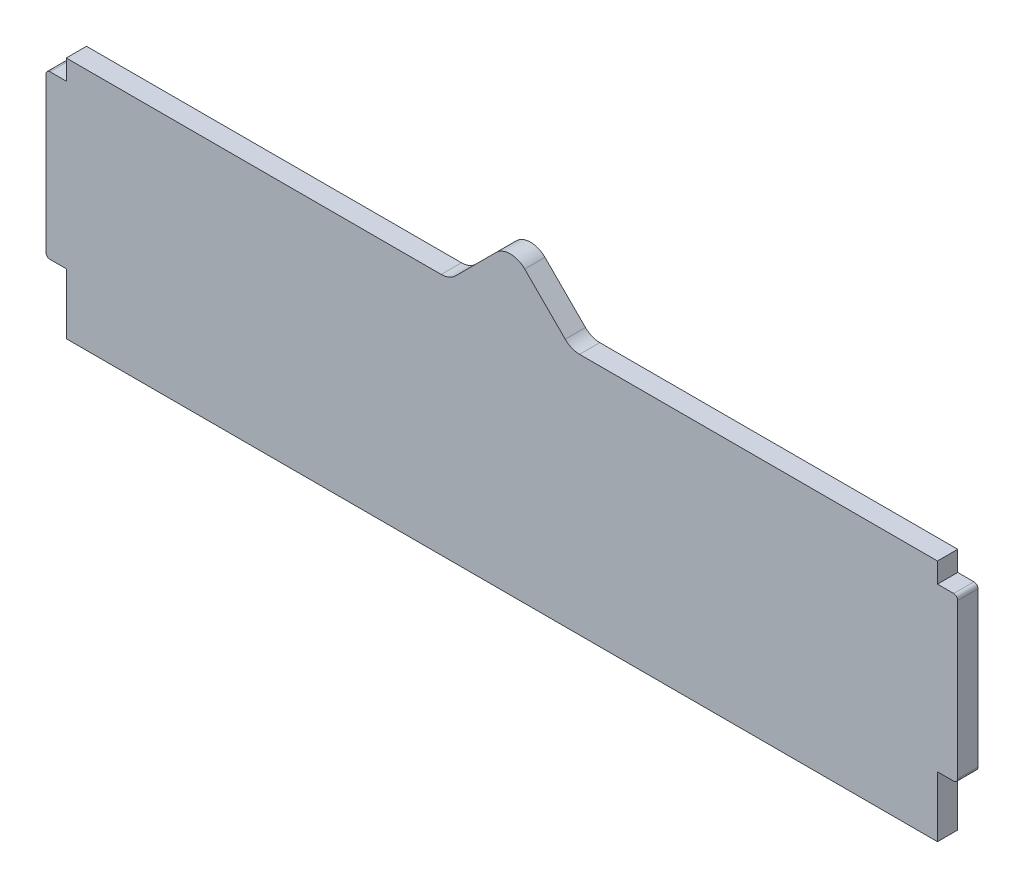
ISO-10303-21;
HEADER;
FILE_DESCRIPTION(('STEP AP214'),'2;1');
FILE_NAME('part.step','',(''),(''),'','','');
FILE_SCHEMA(('AUTOMOTIVE_DESIGN { 1 0 10303 214 1 1 1 1 }'));
ENDSEC;
DATA;
#1=APPLICATION_CONTEXT('core data for automotive mechanical design processes');
#2=APPLICATION_PROTOCOL_DEFINITION('international standard','automotive_design',2000,#1);
#3=PRODUCT_CONTEXT('',#1,'mechanical');
#4=PRODUCT('Part','Part','',(#3));
#5=PRODUCT_RELATED_PRODUCT_CATEGORY('part','',(#4));
#6=PRODUCT_DEFINITION_FORMATION('','',#4);
#7=PRODUCT_DEFINITION_CONTEXT('part definition',#1,'design');
#8=PRODUCT_DEFINITION('design','',#6,#7);
#9=PRODUCT_DEFINITION_SHAPE('','',#8);
#10=(LENGTH_UNIT() NAMED_UNIT(*) SI_UNIT(.MILLI.,.METRE.));
#11=(NAMED_UNIT(*) PLANE_ANGLE_UNIT() SI_UNIT($,.RADIAN.));
#12=(NAMED_UNIT(*) SI_UNIT($,.STERADIAN.) SOLID_ANGLE_UNIT());
#13=UNCERTAINTY_MEASURE_WITH_UNIT(LENGTH_MEASURE(1.E-05),#10,'distance_accuracy_value','');
#14=(GEOMETRIC_REPRESENTATION_CONTEXT(3) GLOBAL_UNCERTAINTY_ASSIGNED_CONTEXT((#13)) GLOBAL_UNIT_ASSIGNED_CONTEXT((#10,
#11,#12)) REPRESENTATION_CONTEXT('',''));
#15=CARTESIAN_POINT('',(0.,0.,0.));
#16=DIRECTION('',(0.,0.,1.));
#17=DIRECTION('',(1.,0.,0.));
#18=AXIS2_PLACEMENT_3D('',#15,#16,#17);
#19=CARTESIAN_POINT('',(0.,0.,5.));
#20=DIRECTION('',(1.,0.,0.));
#21=DIRECTION('',(0.,0.,-1.));
#22=AXIS2_PLACEMENT_3D('',#19,#20,#21);
#23=PLANE('',#22);
#24=DIRECTION('',(0.,-1.,0.));
#25=VECTOR('',#24,1.);
#26=CARTESIAN_POINT('',(0.,0.,0.));
#27=LINE('',#26,#25);
#28=CARTESIAN_POINT('',(0.,14.95,0.));
#29=VERTEX_POINT('',#28);
#30=CARTESIAN_POINT('',(0.,0.,0.));
#31=VERTEX_POINT('',#30);
#32=EDGE_CURVE('E214',#29,#31,#27,.T.);
#33=ORIENTED_EDGE('',*,*,#32,.T.);
#34=DIRECTION('',(0.,0.,-1.));
#35=VECTOR('',#34,1.);
#36=CARTESIAN_POINT('',(0.,0.,5.));
#37=LINE('',#36,#35);
#38=CARTESIAN_POINT('',(0.,0.,5.));
#39=VERTEX_POINT('',#38);
#40=EDGE_CURVE('E195',#39,#31,#37,.T.);
#41=ORIENTED_EDGE('',*,*,#40,.F.);
#42=DIRECTION('',(0.,-1.,0.));
#43=VECTOR('',#42,1.);
#44=CARTESIAN_POINT('',(0.,0.,5.));
#45=LINE('',#44,#43);
#46=CARTESIAN_POINT('',(0.,14.95,5.));
#47=VERTEX_POINT('',#46);
#48=EDGE_CURVE('E201',#47,#39,#45,.T.);
#49=ORIENTED_EDGE('',*,*,#48,.F.);
#50=DIRECTION('',(0.,0.,-1.));
#51=VECTOR('',#50,1.);
#52=CARTESIAN_POINT('',(0.,14.95,5.));
#53=LINE('',#52,#51);
#54=EDGE_CURVE('E328',#47,#29,#53,.T.);
#55=ORIENTED_EDGE('',*,*,#54,.T.);
#56=EDGE_LOOP('',(#33,#41,#49,#55));
#57=FACE_BOUND('',#56,.T.);
#58=ADVANCED_FACE('F40',(#57),#23,.F.);
#59=CARTESIAN_POINT('',(0.,0.,5.));
#60=DIRECTION('',(0.,1.,0.));
#61=DIRECTION('',(0.,0.,1.));
#62=AXIS2_PLACEMENT_3D('',#59,#60,#61);
#63=PLANE('',#62);
#64=DIRECTION('',(1.,0.,0.));
#65=VECTOR('',#64,1.);
#66=CARTESIAN_POINT('',(0.,0.,0.));
#67=LINE('',#66,#65);
#68=CARTESIAN_POINT('',(215.,0.,0.));
#69=VERTEX_POINT('',#68);
#70=EDGE_CURVE('E343',#31,#69,#67,.T.);
#71=ORIENTED_EDGE('',*,*,#70,.T.);
#72=DIRECTION('',(0.,0.,-1.));
#73=VECTOR('',#72,1.);
#74=CARTESIAN_POINT('',(215.,0.,5.));
#75=LINE('',#74,#73);
#76=CARTESIAN_POINT('',(215.,0.,5.));
#77=VERTEX_POINT('',#76);
#78=EDGE_CURVE('E198',#77,#69,#75,.T.);
#79=ORIENTED_EDGE('',*,*,#78,.F.);
#80=DIRECTION('',(1.,0.,0.));
#81=VECTOR('',#80,1.);
#82=CARTESIAN_POINT('',(0.,0.,5.));
#83=LINE('',#82,#81);
#84=EDGE_CURVE('E191',#39,#77,#83,.T.);
#85=ORIENTED_EDGE('',*,*,#84,.F.);
#86=ORIENTED_EDGE('',*,*,#40,.T.);
#87=EDGE_LOOP('',(#71,#79,#85,#86));
#88=FACE_BOUND('',#87,.T.);
#89=ADVANCED_FACE('F193',(#88),#63,.F.);
#90=CARTESIAN_POINT('',(215.,0.,5.));
#91=DIRECTION('',(-1.,0.,0.));
#92=DIRECTION('',(0.,0.,1.));
#93=AXIS2_PLACEMENT_3D('',#90,#91,#92);
#94=PLANE('',#93);
#95=DIRECTION('',(0.,1.,0.));
#96=VECTOR('',#95,1.);
#97=CARTESIAN_POINT('',(215.,0.,0.));
#98=LINE('',#97,#96);
#99=CARTESIAN_POINT('',(215.,14.95,0.));
#100=VERTEX_POINT('',#99);
#101=EDGE_CURVE('E303',#69,#100,#98,.T.);
#102=ORIENTED_EDGE('',*,*,#101,.T.);
#103=DIRECTION('',(0.,0.,-1.));
#104=VECTOR('',#103,1.);
#105=CARTESIAN_POINT('',(215.,14.95,5.));
#106=LINE('',#105,#104);
#107=CARTESIAN_POINT('',(215.,14.95,5.));
#108=VERTEX_POINT('',#107);
#109=EDGE_CURVE('E220',#108,#100,#106,.T.);
#110=ORIENTED_EDGE('',*,*,#109,.F.);
#111=DIRECTION('',(0.,1.,0.));
#112=VECTOR('',#111,1.);
#113=CARTESIAN_POINT('',(215.,0.,5.));
#114=LINE('',#113,#112);
#115=EDGE_CURVE('E200',#77,#108,#114,.T.);
#116=ORIENTED_EDGE('',*,*,#115,.F.);
#117=ORIENTED_EDGE('',*,*,#78,.T.);
#118=EDGE_LOOP('',(#102,#110,#116,#117));
#119=FACE_BOUND('',#118,.T.);
#120=ADVANCED_FACE('F452',(#119),#94,.F.);
#121=CARTESIAN_POINT('',(215.,14.95,5.));
#122=DIRECTION('',(0.,1.,0.));
#123=DIRECTION('',(0.,0.,1.));
#124=AXIS2_PLACEMENT_3D('',#121,#122,#123);
#125=PLANE('',#124);
#126=DIRECTION('',(1.,0.,0.));
#127=VECTOR('',#126,1.);
#128=CARTESIAN_POINT('',(215.,14.95,0.));
#129=LINE('',#128,#127);
#130=CARTESIAN_POINT('',(219.,14.95,0.));
#131=VERTEX_POINT('',#130);
#132=EDGE_CURVE('E284',#100,#131,#129,.T.);
#133=ORIENTED_EDGE('',*,*,#132,.T.);
#134=DIRECTION('',(0.,0.,-1.));
#135=VECTOR('',#134,1.);
#136=CARTESIAN_POINT('',(219.,14.95,5.));
#137=LINE('',#136,#135);
#138=CARTESIAN_POINT('',(219.,14.95,5.));
#139=VERTEX_POINT('',#138);
#140=EDGE_CURVE('E48',#131,#139,#137,.F.);
#141=ORIENTED_EDGE('',*,*,#140,.T.);
#142=DIRECTION('',(1.,0.,0.));
#143=VECTOR('',#142,1.);
#144=CARTESIAN_POINT('',(215.,14.95,5.));
#145=LINE('',#144,#143);
#146=EDGE_CURVE('E282',#108,#139,#145,.T.);
#147=ORIENTED_EDGE('',*,*,#146,.F.);
#148=ORIENTED_EDGE('',*,*,#109,.T.);
#149=EDGE_LOOP('',(#133,#141,#147,#148));
#150=FACE_BOUND('',#149,.T.);
#151=ADVANCED_FACE('F280',(#150),#125,.F.);
#152=CARTESIAN_POINT('',(220.,55.05,5.));
#153=DIRECTION('',(-1.,0.,0.));
#154=DIRECTION('',(0.,0.,1.));
#155=AXIS2_PLACEMENT_3D('',#152,#153,#154);
#156=PLANE('',#155);
#157=DIRECTION('',(0.,1.,0.));
#158=VECTOR('',#157,1.);
#159=CARTESIAN_POINT('',(220.,55.05,5.));
#160=LINE('',#159,#158);
#161=CARTESIAN_POINT('',(220.,15.95,5.));
#162=VERTEX_POINT('',#161);
#163=CARTESIAN_POINT('',(220.,54.05,5.));
#164=VERTEX_POINT('',#163);
#165=EDGE_CURVE('E288',#162,#164,#160,.T.);
#166=ORIENTED_EDGE('',*,*,#165,.F.);
#167=DIRECTION('',(0.,0.,-1.));
#168=VECTOR('',#167,1.);
#169=CARTESIAN_POINT('',(220.,15.95,5.));
#170=LINE('',#169,#168);
#171=CARTESIAN_POINT('',(220.,15.95,0.));
#172=VERTEX_POINT('',#171);
#173=EDGE_CURVE('E273',#162,#172,#170,.T.);
#174=ORIENTED_EDGE('',*,*,#173,.T.);
#175=DIRECTION('',(0.,1.,0.));
#176=VECTOR('',#175,1.);
#177=CARTESIAN_POINT('',(220.,55.05,0.));
#178=LINE('',#177,#176);
#179=CARTESIAN_POINT('',(220.,54.05,0.));
#180=VERTEX_POINT('',#179);
#181=EDGE_CURVE('E294',#172,#180,#178,.T.);
#182=ORIENTED_EDGE('',*,*,#181,.T.);
#183=DIRECTION('',(0.,0.,-1.));
#184=VECTOR('',#183,1.);
#185=CARTESIAN_POINT('',(220.,54.05,5.));
#186=LINE('',#185,#184);
#187=EDGE_CURVE('E63',#180,#164,#186,.F.);
#188=ORIENTED_EDGE('',*,*,#187,.T.);
#189=EDGE_LOOP('',(#166,#174,#182,#188));
#190=FACE_BOUND('',#189,.T.);
#191=ADVANCED_FACE('F293',(#190),#156,.F.);
#192=CARTESIAN_POINT('',(215.,55.05,5.));
#193=DIRECTION('',(0.,-1.,0.));
#194=DIRECTION('',(0.,0.,-1.));
#195=AXIS2_PLACEMENT_3D('',#192,#193,#194);
#196=PLANE('',#195);
#197=DIRECTION('',(-1.,0.,0.));
#198=VECTOR('',#197,1.);
#199=CARTESIAN_POINT('',(215.,55.05,5.));
#200=LINE('',#199,#198);
#201=CARTESIAN_POINT('',(219.,55.05,5.));
#202=VERTEX_POINT('',#201);
#203=CARTESIAN_POINT('',(215.,55.05,5.));
#204=VERTEX_POINT('',#203);
#205=EDGE_CURVE('E368',#202,#204,#200,.T.);
#206=ORIENTED_EDGE('',*,*,#205,.F.);
#207=DIRECTION('',(0.,0.,-1.));
#208=VECTOR('',#207,1.);
#209=CARTESIAN_POINT('',(219.,55.05,5.));
#210=LINE('',#209,#208);
#211=CARTESIAN_POINT('',(219.,55.05,0.));
#212=VERTEX_POINT('',#211);
#213=EDGE_CURVE('E11',#202,#212,#210,.T.);
#214=ORIENTED_EDGE('',*,*,#213,.T.);
#215=DIRECTION('',(-1.,0.,0.));
#216=VECTOR('',#215,1.);
#217=CARTESIAN_POINT('',(215.,55.05,0.));
#218=LINE('',#217,#216);
#219=CARTESIAN_POINT('',(215.,55.05,0.));
#220=VERTEX_POINT('',#219);
#221=EDGE_CURVE('E299',#212,#220,#218,.T.);
#222=ORIENTED_EDGE('',*,*,#221,.T.);
#223=DIRECTION('',(0.,0.,-1.));
#224=VECTOR('',#223,1.);
#225=CARTESIAN_POINT('',(215.,55.05,5.));
#226=LINE('',#225,#224);
#227=EDGE_CURVE('E339',#204,#220,#226,.T.);
#228=ORIENTED_EDGE('',*,*,#227,.F.);
#229=EDGE_LOOP('',(#206,#214,#222,#228));
#230=FACE_BOUND('',#229,.T.);
#231=ADVANCED_FACE('F374',(#230),#196,.F.);
#232=CARTESIAN_POINT('',(215.,55.05,5.));
#233=DIRECTION('',(-1.,0.,0.));
#234=DIRECTION('',(0.,0.,1.));
#235=AXIS2_PLACEMENT_3D('',#232,#233,#234);
#236=PLANE('',#235);
#237=DIRECTION('',(0.,1.,0.));
#238=VECTOR('',#237,1.);
#239=CARTESIAN_POINT('',(215.,55.05,0.));
#240=LINE('',#239,#238);
#241=CARTESIAN_POINT('',(215.,60.,0.));
#242=VERTEX_POINT('',#241);
#243=EDGE_CURVE('E301',#220,#242,#240,.T.);
#244=ORIENTED_EDGE('',*,*,#243,.T.);
#245=DIRECTION('',(0.,0.,-1.));
#246=VECTOR('',#245,1.);
#247=CARTESIAN_POINT('',(215.,60.,5.));
#248=LINE('',#247,#246);
#249=CARTESIAN_POINT('',(215.,60.,5.));
#250=VERTEX_POINT('',#249);
#251=EDGE_CURVE('E336',#250,#242,#248,.T.);
#252=ORIENTED_EDGE('',*,*,#251,.F.);
#253=DIRECTION('',(0.,1.,0.));
#254=VECTOR('',#253,1.);
#255=CARTESIAN_POINT('',(215.,55.05,5.));
#256=LINE('',#255,#254);
#257=EDGE_CURVE('E366',#204,#250,#256,.T.);
#258=ORIENTED_EDGE('',*,*,#257,.F.);
#259=ORIENTED_EDGE('',*,*,#227,.T.);
#260=EDGE_LOOP('',(#244,#252,#258,#259));
#261=FACE_BOUND('',#260,.T.);
#262=ADVANCED_FACE('F380',(#261),#236,.F.);
#263=CARTESIAN_POINT('',(124.59563517177,60.,5.));
#264=DIRECTION('',(0.,-1.,0.));
#265=DIRECTION('',(0.,0.,-1.));
#266=AXIS2_PLACEMENT_3D('',#263,#264,#265);
#267=PLANE('',#266);
#268=DIRECTION('',(-1.,0.,0.));
#269=VECTOR('',#268,1.);
#270=CARTESIAN_POINT('',(124.59563517177,60.,0.));
#271=LINE('',#270,#269);
#272=CARTESIAN_POINT('',(126.666702983635,60.,0.));
#273=VERTEX_POINT('',#272);
#274=EDGE_CURVE('E308',#242,#273,#271,.T.);
#275=ORIENTED_EDGE('',*,*,#274,.T.);
#276=DIRECTION('',(0.,0.,-1.));
#277=VECTOR('',#276,1.);
#278=CARTESIAN_POINT('',(126.666702983635,60.,5.));
#279=LINE('',#278,#277);
#280=CARTESIAN_POINT('',(126.666702983635,60.,5.));
#281=VERTEX_POINT('',#280);
#282=EDGE_CURVE('E233',#273,#281,#279,.F.);
#283=ORIENTED_EDGE('',*,*,#282,.T.);
#284=DIRECTION('',(-1.,0.,0.));
#285=VECTOR('',#284,1.);
#286=CARTESIAN_POINT('',(124.59563517177,60.,5.));
#287=LINE('',#286,#285);
#288=EDGE_CURVE('E363',#250,#281,#287,.T.);
#289=ORIENTED_EDGE('',*,*,#288,.F.);
#290=ORIENTED_EDGE('',*,*,#251,.T.);
#291=EDGE_LOOP('',(#275,#283,#289,#290));
#292=FACE_BOUND('',#291,.T.);
#293=ADVANCED_FACE('F384',(#292),#267,.F.);
#294=CARTESIAN_POINT('',(109.59563517177,75.,5.));
#295=DIRECTION('',(-0.707106781186548,-0.707106781186548,0.));
#296=DIRECTION('',(0.707106781186548,-0.707106781186548,0.));
#297=AXIS2_PLACEMENT_3D('',#294,#295,#296);
#298=PLANE('',#297);
#299=DIRECTION('',(-0.707106781186547,0.707106781186547,0.));
#300=VECTOR('',#299,1.);
#301=CARTESIAN_POINT('',(109.59563517177,75.,5.));
#302=LINE('',#301,#300);
#303=CARTESIAN_POINT('',(123.131169077702,61.4644660940673,5.));
#304=VERTEX_POINT('',#303);
#305=CARTESIAN_POINT('',(113.131169077702,71.4644660940673,5.));
#306=VERTEX_POINT('',#305);
#307=EDGE_CURVE('E360',#304,#306,#302,.T.);
#308=ORIENTED_EDGE('',*,*,#307,.F.);
#309=DIRECTION('',(0.,0.,-1.));
#310=VECTOR('',#309,1.);
#311=CARTESIAN_POINT('',(123.131169077702,61.4644660940673,0.));
#312=LINE('',#311,#310);
#313=CARTESIAN_POINT('',(123.131169077702,61.4644660940673,0.));
#314=VERTEX_POINT('',#313);
#315=EDGE_CURVE('E230',#304,#314,#312,.T.);
#316=ORIENTED_EDGE('',*,*,#315,.T.);
#317=DIRECTION('',(-0.707106781186547,0.707106781186547,0.));
#318=VECTOR('',#317,1.);
#319=CARTESIAN_POINT('',(109.59563517177,75.,0.));
#320=LINE('',#319,#318);
#321=CARTESIAN_POINT('',(113.131169077702,71.4644660940673,0.));
#322=VERTEX_POINT('',#321);
#323=EDGE_CURVE('E311',#314,#322,#320,.T.);
#324=ORIENTED_EDGE('',*,*,#323,.T.);
#325=DIRECTION('',(0.,0.,-1.));
#326=VECTOR('',#325,1.);
#327=CARTESIAN_POINT('',(113.131169077702,71.4644660940673,5.));
#328=LINE('',#327,#326);
#329=EDGE_CURVE('E228',#322,#306,#328,.F.);
#330=ORIENTED_EDGE('',*,*,#329,.T.);
#331=EDGE_LOOP('',(#308,#316,#324,#330));
#332=FACE_BOUND('',#331,.T.);
#333=ADVANCED_FACE('F393',(#332),#298,.F.);
#334=CARTESIAN_POINT('',(94.5956351717697,60.,5.));
#335=DIRECTION('',(0.707106781186548,-0.707106781186548,0.));
#336=DIRECTION('',(0.707106781186548,0.707106781186548,0.));
#337=AXIS2_PLACEMENT_3D('',#334,#335,#336);
#338=PLANE('',#337);
#339=DIRECTION('',(-0.707106781186547,-0.707106781186547,0.));
#340=VECTOR('',#339,1.);
#341=CARTESIAN_POINT('',(94.5956351717697,60.,0.));
#342=LINE('',#341,#340);
#343=CARTESIAN_POINT('',(106.060101265837,71.4644660940673,0.));
#344=VERTEX_POINT('',#343);
#345=CARTESIAN_POINT('',(96.060101265837,61.4644660940673,0.));
#346=VERTEX_POINT('',#345);
#347=EDGE_CURVE('E314',#344,#346,#342,.T.);
#348=ORIENTED_EDGE('',*,*,#347,.T.);
#349=DIRECTION('',(0.,0.,-1.));
#350=VECTOR('',#349,1.);
#351=CARTESIAN_POINT('',(96.060101265837,61.4644660940673,5.));
#352=LINE('',#351,#350);
#353=CARTESIAN_POINT('',(96.060101265837,61.4644660940673,5.));
#354=VERTEX_POINT('',#353);
#355=EDGE_CURVE('E226',#346,#354,#352,.F.);
#356=ORIENTED_EDGE('',*,*,#355,.T.);
#357=DIRECTION('',(-0.707106781186547,-0.707106781186547,0.));
#358=VECTOR('',#357,1.);
#359=CARTESIAN_POINT('',(94.5956351717697,60.,5.));
#360=LINE('',#359,#358);
#361=CARTESIAN_POINT('',(106.060101265837,71.4644660940673,5.));
#362=VERTEX_POINT('',#361);
#363=EDGE_CURVE('E357',#362,#354,#360,.T.);
#364=ORIENTED_EDGE('',*,*,#363,.F.);
#365=DIRECTION('',(0.,0.,-1.));
#366=VECTOR('',#365,1.);
#367=CARTESIAN_POINT('',(106.060101265837,71.4644660940673,5.));
#368=LINE('',#367,#366);
#369=EDGE_CURVE('E218',#362,#344,#368,.T.);
#370=ORIENTED_EDGE('',*,*,#369,.T.);
#371=EDGE_LOOP('',(#348,#356,#364,#370));
#372=FACE_BOUND('',#371,.T.);
#373=ADVANCED_FACE('F402',(#372),#338,.F.);
#374=CARTESIAN_POINT('',(0.,60.,5.));
#375=DIRECTION('',(0.,-1.,0.));
#376=DIRECTION('',(0.,0.,-1.));
#377=AXIS2_PLACEMENT_3D('',#374,#375,#376);
#378=PLANE('',#377);
#379=DIRECTION('',(-1.,0.,0.));
#380=VECTOR('',#379,1.);
#381=CARTESIAN_POINT('',(0.,60.,5.));
#382=LINE('',#381,#380);
#383=CARTESIAN_POINT('',(92.5245673599042,60.,5.));
#384=VERTEX_POINT('',#383);
#385=CARTESIAN_POINT('',(0.,60.,5.));
#386=VERTEX_POINT('',#385);
#387=EDGE_CURVE('E355',#384,#386,#382,.T.);
#388=ORIENTED_EDGE('',*,*,#387,.F.);
#389=DIRECTION('',(0.,0.,-1.));
#390=VECTOR('',#389,1.);
#391=CARTESIAN_POINT('',(92.5245673599042,60.,0.));
#392=LINE('',#391,#390);
#393=CARTESIAN_POINT('',(92.5245673599042,60.,0.));
#394=VERTEX_POINT('',#393);
#395=EDGE_CURVE('E215',#384,#394,#392,.T.);
#396=ORIENTED_EDGE('',*,*,#395,.T.);
#397=DIRECTION('',(-1.,0.,0.));
#398=VECTOR('',#397,1.);
#399=CARTESIAN_POINT('',(0.,60.,0.));
#400=LINE('',#399,#398);
#401=CARTESIAN_POINT('',(0.,60.,0.));
#402=VERTEX_POINT('',#401);
#403=EDGE_CURVE('E317',#394,#402,#400,.T.);
#404=ORIENTED_EDGE('',*,*,#403,.T.);
#405=DIRECTION('',(0.,0.,-1.));
#406=VECTOR('',#405,1.);
#407=CARTESIAN_POINT('',(0.,60.,5.));
#408=LINE('',#407,#406);
#409=EDGE_CURVE('E333',#386,#402,#408,.T.);
#410=ORIENTED_EDGE('',*,*,#409,.F.);
#411=EDGE_LOOP('',(#388,#396,#404,#410));
#412=FACE_BOUND('',#411,.T.);
#413=ADVANCED_FACE('F411',(#412),#378,.F.);
#414=CARTESIAN_POINT('',(0.,55.05,5.));
#415=DIRECTION('',(1.,0.,0.));
#416=DIRECTION('',(0.,0.,-1.));
#417=AXIS2_PLACEMENT_3D('',#414,#415,#416);
#418=PLANE('',#417);
#419=DIRECTION('',(0.,-1.,0.));
#420=VECTOR('',#419,1.);
#421=CARTESIAN_POINT('',(0.,55.05,0.));
#422=LINE('',#421,#420);
#423=CARTESIAN_POINT('',(0.,55.05,0.));
#424=VERTEX_POINT('',#423);
#425=EDGE_CURVE('E319',#402,#424,#422,.T.);
#426=ORIENTED_EDGE('',*,*,#425,.T.);
#427=DIRECTION('',(0.,0.,-1.));
#428=VECTOR('',#427,1.);
#429=CARTESIAN_POINT('',(0.,55.05,5.));
#430=LINE('',#429,#428);
#431=CARTESIAN_POINT('',(0.,55.05,5.));
#432=VERTEX_POINT('',#431);
#433=EDGE_CURVE('E330',#432,#424,#430,.T.);
#434=ORIENTED_EDGE('',*,*,#433,.F.);
#435=DIRECTION('',(0.,-1.,0.));
#436=VECTOR('',#435,1.);
#437=CARTESIAN_POINT('',(0.,55.05,5.));
#438=LINE('',#437,#436);
#439=EDGE_CURVE('E353',#386,#432,#438,.T.);
#440=ORIENTED_EDGE('',*,*,#439,.F.);
#441=ORIENTED_EDGE('',*,*,#409,.T.);
#442=EDGE_LOOP('',(#426,#434,#440,#441));
#443=FACE_BOUND('',#442,.T.);
#444=ADVANCED_FACE('F417',(#443),#418,.F.);
#445=CARTESIAN_POINT('',(0.,55.05,5.));
#446=DIRECTION('',(0.,-1.,0.));
#447=DIRECTION('',(0.,0.,-1.));
#448=AXIS2_PLACEMENT_3D('',#445,#446,#447);
#449=PLANE('',#448);
#450=DIRECTION('',(-1.,0.,0.));
#451=VECTOR('',#450,1.);
#452=CARTESIAN_POINT('',(0.,55.05,0.));
#453=LINE('',#452,#451);
#454=CARTESIAN_POINT('',(-4.,55.05,0.));
#455=VERTEX_POINT('',#454);
#456=EDGE_CURVE('E321',#424,#455,#453,.T.);
#457=ORIENTED_EDGE('',*,*,#456,.T.);
#458=DIRECTION('',(0.,0.,-1.));
#459=VECTOR('',#458,1.);
#460=CARTESIAN_POINT('',(-4.,55.05,5.));
#461=LINE('',#460,#459);
#462=CARTESIAN_POINT('',(-4.,55.05,5.));
#463=VERTEX_POINT('',#462);
#464=EDGE_CURVE('E260',#455,#463,#461,.F.);
#465=ORIENTED_EDGE('',*,*,#464,.T.);
#466=DIRECTION('',(-1.,0.,0.));
#467=VECTOR('',#466,1.);
#468=CARTESIAN_POINT('',(0.,55.05,5.));
#469=LINE('',#468,#467);
#470=EDGE_CURVE('E351',#432,#463,#469,.T.);
#471=ORIENTED_EDGE('',*,*,#470,.F.);
#472=ORIENTED_EDGE('',*,*,#433,.T.);
#473=EDGE_LOOP('',(#457,#465,#471,#472));
#474=FACE_BOUND('',#473,.T.);
#475=ADVANCED_FACE('F421',(#474),#449,.F.);
#476=CARTESIAN_POINT('',(-5.,55.05,5.));
#477=DIRECTION('',(1.,0.,0.));
#478=DIRECTION('',(0.,1.,0.));
#479=AXIS2_PLACEMENT_3D('',#476,#477,#478);
#480=PLANE('',#479);
#481=DIRECTION('',(0.,-1.,0.));
#482=VECTOR('',#481,1.);
#483=CARTESIAN_POINT('',(-5.,55.05,5.));
#484=LINE('',#483,#482);
#485=CARTESIAN_POINT('',(-5.,54.05,5.));
#486=VERTEX_POINT('',#485);
#487=CARTESIAN_POINT('',(-4.99999999999999,15.95,5.));
#488=VERTEX_POINT('',#487);
#489=EDGE_CURVE('E348',#486,#488,#484,.T.);
#490=ORIENTED_EDGE('',*,*,#489,.F.);
#491=DIRECTION('',(0.,0.,-1.));
#492=VECTOR('',#491,1.);
#493=CARTESIAN_POINT('',(-5.,54.05,5.));
#494=LINE('',#493,#492);
#495=CARTESIAN_POINT('',(-5.,54.05,0.));
#496=VERTEX_POINT('',#495);
#497=EDGE_CURVE('E249',#486,#496,#494,.T.);
#498=ORIENTED_EDGE('',*,*,#497,.T.);
#499=DIRECTION('',(0.,-1.,0.));
#500=VECTOR('',#499,1.);
#501=CARTESIAN_POINT('',(-5.,55.05,0.));
#502=LINE('',#501,#500);
#503=CARTESIAN_POINT('',(-4.99999999999999,15.95,0.));
#504=VERTEX_POINT('',#503);
#505=EDGE_CURVE('E324',#496,#504,#502,.T.);
#506=ORIENTED_EDGE('',*,*,#505,.T.);
#507=DIRECTION('',(0.,0.,-1.));
#508=VECTOR('',#507,1.);
#509=CARTESIAN_POINT('',(-4.99999999999999,15.95,5.));
#510=LINE('',#509,#508);
#511=EDGE_CURVE('E247',#504,#488,#510,.F.);
#512=ORIENTED_EDGE('',*,*,#511,.T.);
#513=EDGE_LOOP('',(#490,#498,#506,#512));
#514=FACE_BOUND('',#513,.T.);
#515=ADVANCED_FACE('F429',(#514),#480,.F.);
#516=CARTESIAN_POINT('',(0.,14.95,5.));
#517=DIRECTION('',(0.,1.,0.));
#518=DIRECTION('',(0.,0.,1.));
#519=AXIS2_PLACEMENT_3D('',#516,#517,#518);
#520=PLANE('',#519);
#521=DIRECTION('',(1.,0.,0.));
#522=VECTOR('',#521,1.);
#523=CARTESIAN_POINT('',(0.,14.95,5.));
#524=LINE('',#523,#522);
#525=CARTESIAN_POINT('',(-3.99999999999999,14.95,5.));
#526=VERTEX_POINT('',#525);
#527=EDGE_CURVE('E207',#526,#47,#524,.T.);
#528=ORIENTED_EDGE('',*,*,#527,.F.);
#529=DIRECTION('',(0.,0.,-1.));
#530=VECTOR('',#529,1.);
#531=CARTESIAN_POINT('',(-3.99999999999999,14.95,5.));
#532=LINE('',#531,#530);
#533=CARTESIAN_POINT('',(-3.99999999999999,14.95,0.));
#534=VERTEX_POINT('',#533);
#535=EDGE_CURVE('E269',#526,#534,#532,.T.);
#536=ORIENTED_EDGE('',*,*,#535,.T.);
#537=DIRECTION('',(1.,0.,0.));
#538=VECTOR('',#537,1.);
#539=CARTESIAN_POINT('',(0.,14.95,0.));
#540=LINE('',#539,#538);
#541=EDGE_CURVE('E211',#534,#29,#540,.T.);
#542=ORIENTED_EDGE('',*,*,#541,.T.);
#543=ORIENTED_EDGE('',*,*,#54,.F.);
#544=EDGE_LOOP('',(#528,#536,#542,#543));
#545=FACE_BOUND('',#544,.T.);
#546=ADVANCED_FACE('F437',(#545),#520,.F.);
#547=CARTESIAN_POINT('',(0.,0.,5.));
#548=DIRECTION('',(0.,0.,1.));
#549=DIRECTION('',(1.,0.,0.));
#550=AXIS2_PLACEMENT_3D('',#547,#548,#549);
#551=PLANE('',#550);
#552=ORIENTED_EDGE('',*,*,#470,.T.);
#553=CARTESIAN_POINT('',(-4.,54.05,5.));
#554=DIRECTION('',(0.,0.,1.));
#555=DIRECTION('',(1.,0.,0.));
#556=AXIS2_PLACEMENT_3D('',#553,#554,#555);
#557=CIRCLE('',#556,1.);
#558=EDGE_CURVE('E267',#463,#486,#557,.T.);
#559=ORIENTED_EDGE('',*,*,#558,.T.);
#560=ORIENTED_EDGE('',*,*,#489,.T.);
#561=CARTESIAN_POINT('',(-3.99999999999999,15.95,5.));
#562=DIRECTION('',(0.,0.,1.));
#563=DIRECTION('',(1.,0.,0.));
#564=AXIS2_PLACEMENT_3D('',#561,#562,#563);
#565=CIRCLE('',#564,1.);
#566=EDGE_CURVE('E265',#488,#526,#565,.T.);
#567=ORIENTED_EDGE('',*,*,#566,.T.);
#568=ORIENTED_EDGE('',*,*,#527,.T.);
#569=ORIENTED_EDGE('',*,*,#48,.T.);
#570=ORIENTED_EDGE('',*,*,#84,.T.);
#571=ORIENTED_EDGE('',*,*,#115,.T.);
#572=ORIENTED_EDGE('',*,*,#146,.T.);
#573=CARTESIAN_POINT('',(219.,15.95,5.));
#574=DIRECTION('',(0.,0.,1.));
#575=DIRECTION('',(1.,0.,0.));
#576=AXIS2_PLACEMENT_3D('',#573,#574,#575);
#577=CIRCLE('',#576,1.);
#578=EDGE_CURVE('E263',#139,#162,#577,.T.);
#579=ORIENTED_EDGE('',*,*,#578,.T.);
#580=ORIENTED_EDGE('',*,*,#165,.T.);
#581=CARTESIAN_POINT('',(219.,54.05,5.));
#582=DIRECTION('',(0.,0.,1.));
#583=DIRECTION('',(1.,0.,0.));
#584=AXIS2_PLACEMENT_3D('',#581,#582,#583);
#585=CIRCLE('',#584,1.);
#586=EDGE_CURVE('E55',#164,#202,#585,.T.);
#587=ORIENTED_EDGE('',*,*,#586,.T.);
#588=ORIENTED_EDGE('',*,*,#205,.T.);
#589=ORIENTED_EDGE('',*,*,#257,.T.);
#590=ORIENTED_EDGE('',*,*,#288,.T.);
#591=CARTESIAN_POINT('',(126.666702983635,65.,5.));
#592=DIRECTION('',(0.,0.,1.));
#593=DIRECTION('',(1.,0.,0.));
#594=AXIS2_PLACEMENT_3D('',#591,#592,#593);
#595=CIRCLE('',#594,5.);
#596=EDGE_CURVE('E245',#281,#304,#595,.F.);
#597=ORIENTED_EDGE('',*,*,#596,.T.);
#598=ORIENTED_EDGE('',*,*,#307,.T.);
#599=CARTESIAN_POINT('',(109.59563517177,67.9289321881345,5.));
#600=DIRECTION('',(0.,0.,1.));
#601=DIRECTION('',(1.,0.,0.));
#602=AXIS2_PLACEMENT_3D('',#599,#600,#601);
#603=CIRCLE('',#602,5.);
#604=EDGE_CURVE('E237',#306,#362,#603,.T.);
#605=ORIENTED_EDGE('',*,*,#604,.T.);
#606=ORIENTED_EDGE('',*,*,#363,.T.);
#607=CARTESIAN_POINT('',(92.5245673599042,65.,5.));
#608=DIRECTION('',(0.,0.,1.));
#609=DIRECTION('',(1.,0.,0.));
#610=AXIS2_PLACEMENT_3D('',#607,#608,#609);
#611=CIRCLE('',#610,5.);
#612=EDGE_CURVE('E241',#354,#384,#611,.F.);
#613=ORIENTED_EDGE('',*,*,#612,.T.);
#614=ORIENTED_EDGE('',*,*,#387,.T.);
#615=ORIENTED_EDGE('',*,*,#439,.T.);
#616=EDGE_LOOP('',(#552,#559,#560,#567,#568,#569,#570,#571,#572,#579,#580,#587,#588,#589,#590,
#597,#598,#605,#606,#613,#614,#615));
#617=FACE_BOUND('',#616,.T.);
#618=ADVANCED_FACE('F205',(#617),#551,.T.);
#619=CARTESIAN_POINT('',(0.,0.,0.));
#620=DIRECTION('',(0.,0.,1.));
#621=DIRECTION('',(1.,0.,0.));
#622=AXIS2_PLACEMENT_3D('',#619,#620,#621);
#623=PLANE('',#622);
#624=ORIENTED_EDGE('',*,*,#505,.F.);
#625=CARTESIAN_POINT('',(-4.,54.05,0.));
#626=DIRECTION('',(0.,0.,1.));
#627=DIRECTION('',(1.,0.,0.));
#628=AXIS2_PLACEMENT_3D('',#625,#626,#627);
#629=CIRCLE('',#628,1.);
#630=EDGE_CURVE('E258',#496,#455,#629,.F.);
#631=ORIENTED_EDGE('',*,*,#630,.T.);
#632=ORIENTED_EDGE('',*,*,#456,.F.);
#633=ORIENTED_EDGE('',*,*,#425,.F.);
#634=ORIENTED_EDGE('',*,*,#403,.F.);
#635=CARTESIAN_POINT('',(92.5245673599042,65.,0.));
#636=DIRECTION('',(0.,0.,1.));
#637=DIRECTION('',(1.,0.,0.));
#638=AXIS2_PLACEMENT_3D('',#635,#636,#637);
#639=CIRCLE('',#638,5.);
#640=EDGE_CURVE('E239',#394,#346,#639,.T.);
#641=ORIENTED_EDGE('',*,*,#640,.T.);
#642=ORIENTED_EDGE('',*,*,#347,.F.);
#643=CARTESIAN_POINT('',(109.59563517177,67.9289321881345,0.));
#644=DIRECTION('',(0.,0.,1.));
#645=DIRECTION('',(1.,0.,0.));
#646=AXIS2_PLACEMENT_3D('',#643,#644,#645);
#647=CIRCLE('',#646,5.);
#648=EDGE_CURVE('E235',#344,#322,#647,.F.);
#649=ORIENTED_EDGE('',*,*,#648,.T.);
#650=ORIENTED_EDGE('',*,*,#323,.F.);
#651=CARTESIAN_POINT('',(126.666702983635,65.,0.));
#652=DIRECTION('',(0.,0.,1.));
#653=DIRECTION('',(1.,0.,0.));
#654=AXIS2_PLACEMENT_3D('',#651,#652,#653);
#655=CIRCLE('',#654,5.);
#656=EDGE_CURVE('E243',#314,#273,#655,.T.);
#657=ORIENTED_EDGE('',*,*,#656,.T.);
#658=ORIENTED_EDGE('',*,*,#274,.F.);
#659=ORIENTED_EDGE('',*,*,#243,.F.);
#660=ORIENTED_EDGE('',*,*,#221,.F.);
#661=CARTESIAN_POINT('',(219.,54.05,0.));
#662=DIRECTION('',(0.,0.,1.));
#663=DIRECTION('',(1.,0.,0.));
#664=AXIS2_PLACEMENT_3D('',#661,#662,#663);
#665=CIRCLE('',#664,1.);
#666=EDGE_CURVE('E252',#212,#180,#665,.F.);
#667=ORIENTED_EDGE('',*,*,#666,.T.);
#668=ORIENTED_EDGE('',*,*,#181,.F.);
#669=CARTESIAN_POINT('',(219.,15.95,0.));
#670=DIRECTION('',(0.,0.,1.));
#671=DIRECTION('',(1.,0.,0.));
#672=AXIS2_PLACEMENT_3D('',#669,#670,#671);
#673=CIRCLE('',#672,1.);
#674=EDGE_CURVE('E254',#172,#131,#673,.F.);
#675=ORIENTED_EDGE('',*,*,#674,.T.);
#676=ORIENTED_EDGE('',*,*,#132,.F.);
#677=ORIENTED_EDGE('',*,*,#101,.F.);
#678=ORIENTED_EDGE('',*,*,#70,.F.);
#679=ORIENTED_EDGE('',*,*,#32,.F.);
#680=ORIENTED_EDGE('',*,*,#541,.F.);
#681=CARTESIAN_POINT('',(-3.99999999999999,15.95,0.));
#682=DIRECTION('',(0.,0.,1.));
#683=DIRECTION('',(1.,0.,0.));
#684=AXIS2_PLACEMENT_3D('',#681,#682,#683);
#685=CIRCLE('',#684,1.);
#686=EDGE_CURVE('E256',#534,#504,#685,.F.);
#687=ORIENTED_EDGE('',*,*,#686,.T.);
#688=EDGE_LOOP('',(#624,#631,#632,#633,#634,#641,#642,#649,#650,#657,#658,#659,#660,#667,#668,
#675,#676,#677,#678,#679,#680,#687));
#689=FACE_BOUND('',#688,.T.);
#690=ADVANCED_FACE('F297',(#689),#623,.F.);
#691=CARTESIAN_POINT('',(92.5245673599042,65.,5.));
#692=DIRECTION('',(0.,0.,1.));
#693=DIRECTION('',(1.,0.,0.));
#694=AXIS2_PLACEMENT_3D('',#691,#692,#693);
#695=CYLINDRICAL_SURFACE('',#694,5.);
#696=ORIENTED_EDGE('',*,*,#612,.F.);
#697=ORIENTED_EDGE('',*,*,#355,.F.);
#698=ORIENTED_EDGE('',*,*,#640,.F.);
#699=ORIENTED_EDGE('',*,*,#395,.F.);
#700=EDGE_LOOP('',(#696,#697,#698,#699));
#701=FACE_BOUND('',#700,.T.);
#702=ADVANCED_FACE('F408',(#701),#695,.F.);
#703=CARTESIAN_POINT('',(126.666702983635,65.,5.));
#704=DIRECTION('',(0.,0.,1.));
#705=DIRECTION('',(1.,0.,0.));
#706=AXIS2_PLACEMENT_3D('',#703,#704,#705);
#707=CYLINDRICAL_SURFACE('',#706,5.);
#708=ORIENTED_EDGE('',*,*,#596,.F.);
#709=ORIENTED_EDGE('',*,*,#282,.F.);
#710=ORIENTED_EDGE('',*,*,#656,.F.);
#711=ORIENTED_EDGE('',*,*,#315,.F.);
#712=EDGE_LOOP('',(#708,#709,#710,#711));
#713=FACE_BOUND('',#712,.T.);
#714=ADVANCED_FACE('F390',(#713),#707,.F.);
#715=CARTESIAN_POINT('',(109.59563517177,67.9289321881345,5.));
#716=DIRECTION('',(0.,0.,-1.));
#717=DIRECTION('',(-1.,0.,0.));
#718=AXIS2_PLACEMENT_3D('',#715,#716,#717);
#719=CYLINDRICAL_SURFACE('',#718,5.);
#720=ORIENTED_EDGE('',*,*,#604,.F.);
#721=ORIENTED_EDGE('',*,*,#329,.F.);
#722=ORIENTED_EDGE('',*,*,#648,.F.);
#723=ORIENTED_EDGE('',*,*,#369,.F.);
#724=EDGE_LOOP('',(#720,#721,#722,#723));
#725=FACE_BOUND('',#724,.T.);
#726=ADVANCED_FACE('F399',(#725),#719,.T.);
#727=CARTESIAN_POINT('',(-4.,54.05,5.));
#728=DIRECTION('',(0.,0.,-1.));
#729=DIRECTION('',(-1.,0.,0.));
#730=AXIS2_PLACEMENT_3D('',#727,#728,#729);
#731=CYLINDRICAL_SURFACE('',#730,1.);
#732=ORIENTED_EDGE('',*,*,#558,.F.);
#733=ORIENTED_EDGE('',*,*,#464,.F.);
#734=ORIENTED_EDGE('',*,*,#630,.F.);
#735=ORIENTED_EDGE('',*,*,#497,.F.);
#736=EDGE_LOOP('',(#732,#733,#734,#735));
#737=FACE_BOUND('',#736,.T.);
#738=ADVANCED_FACE('F427',(#737),#731,.T.);
#739=CARTESIAN_POINT('',(-3.99999999999999,15.95,5.));
#740=DIRECTION('',(0.,0.,-1.));
#741=DIRECTION('',(-1.,0.,0.));
#742=AXIS2_PLACEMENT_3D('',#739,#740,#741);
#743=CYLINDRICAL_SURFACE('',#742,1.);
#744=ORIENTED_EDGE('',*,*,#566,.F.);
#745=ORIENTED_EDGE('',*,*,#511,.F.);
#746=ORIENTED_EDGE('',*,*,#686,.F.);
#747=ORIENTED_EDGE('',*,*,#535,.F.);
#748=EDGE_LOOP('',(#744,#745,#746,#747));
#749=FACE_BOUND('',#748,.T.);
#750=ADVANCED_FACE('F435',(#749),#743,.T.);
#751=CARTESIAN_POINT('',(219.,15.95,5.));
#752=DIRECTION('',(0.,0.,-1.));
#753=DIRECTION('',(-1.,0.,0.));
#754=AXIS2_PLACEMENT_3D('',#751,#752,#753);
#755=CYLINDRICAL_SURFACE('',#754,1.);
#756=ORIENTED_EDGE('',*,*,#578,.F.);
#757=ORIENTED_EDGE('',*,*,#140,.F.);
#758=ORIENTED_EDGE('',*,*,#674,.F.);
#759=ORIENTED_EDGE('',*,*,#173,.F.);
#760=EDGE_LOOP('',(#756,#757,#758,#759));
#761=FACE_BOUND('',#760,.T.);
#762=ADVANCED_FACE('F291',(#761),#755,.T.);
#763=CARTESIAN_POINT('',(219.,54.05,5.));
#764=DIRECTION('',(0.,0.,-1.));
#765=DIRECTION('',(-1.,0.,0.));
#766=AXIS2_PLACEMENT_3D('',#763,#764,#765);
#767=CYLINDRICAL_SURFACE('',#766,1.);
#768=ORIENTED_EDGE('',*,*,#586,.F.);
#769=ORIENTED_EDGE('',*,*,#187,.F.);
#770=ORIENTED_EDGE('',*,*,#666,.F.);
#771=ORIENTED_EDGE('',*,*,#213,.F.);
#772=EDGE_LOOP('',(#768,#769,#770,#771));
#773=FACE_BOUND('',#772,.T.);
#774=ADVANCED_FACE('F42',(#773),#767,.T.);
#775=CLOSED_SHELL('',(#58,#89,#120,#151,#191,#231,#262,#293,#333,#373,#413,#444,#475,#515,#546,
#618,#690,#702,#714,#726,#738,#750,#762,#774));
#776=MANIFOLD_SOLID_BREP('B2',#775);
#777=ADVANCED_BREP_SHAPE_REPRESENTATION('',(#18,#776),#14);
#778=SHAPE_DEFINITION_REPRESENTATION(#9,#777);
ENDSEC;
END-ISO-10303-21;
